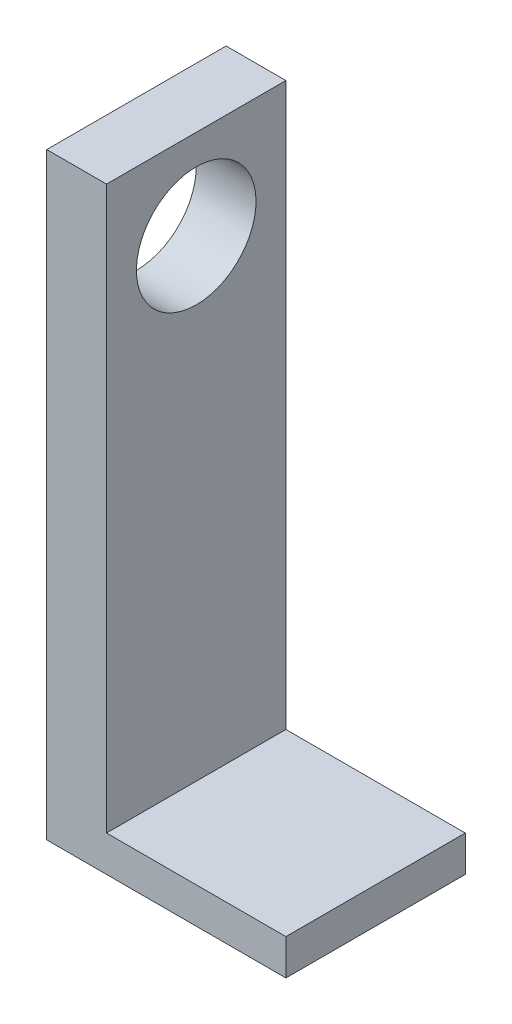
ISO-10303-21;
HEADER;
FILE_DESCRIPTION(('STEP AP214'),'2;1');
FILE_NAME('part.step','',(''),(''),'','','');
FILE_SCHEMA(('AUTOMOTIVE_DESIGN { 1 0 10303 214 1 1 1 1 }'));
ENDSEC;
DATA;
#1=APPLICATION_CONTEXT('core data for automotive mechanical design processes');
#2=APPLICATION_PROTOCOL_DEFINITION('international standard','automotive_design',2000,#1);
#3=PRODUCT_CONTEXT('',#1,'mechanical');
#4=PRODUCT('Part','Part','',(#3));
#5=PRODUCT_RELATED_PRODUCT_CATEGORY('part','',(#4));
#6=PRODUCT_DEFINITION_FORMATION('','',#4);
#7=PRODUCT_DEFINITION_CONTEXT('part definition',#1,'design');
#8=PRODUCT_DEFINITION('design','',#6,#7);
#9=PRODUCT_DEFINITION_SHAPE('','',#8);
#10=(LENGTH_UNIT() NAMED_UNIT(*) SI_UNIT(.MILLI.,.METRE.));
#11=(NAMED_UNIT(*) PLANE_ANGLE_UNIT() SI_UNIT($,.RADIAN.));
#12=(NAMED_UNIT(*) SI_UNIT($,.STERADIAN.) SOLID_ANGLE_UNIT());
#13=UNCERTAINTY_MEASURE_WITH_UNIT(LENGTH_MEASURE(1.E-05),#10,'distance_accuracy_value','');
#14=(GEOMETRIC_REPRESENTATION_CONTEXT(3) GLOBAL_UNCERTAINTY_ASSIGNED_CONTEXT((#13)) GLOBAL_UNIT_ASSIGNED_CONTEXT((#10,
#11,#12)) REPRESENTATION_CONTEXT('',''));
#15=CARTESIAN_POINT('',(0.,0.,0.));
#16=DIRECTION('',(0.,0.,1.));
#17=DIRECTION('',(1.,0.,0.));
#18=AXIS2_PLACEMENT_3D('',#15,#16,#17);
#19=CARTESIAN_POINT('',(0.,50.,15.));
#20=DIRECTION('',(1.,0.,0.));
#21=DIRECTION('',(0.,1.,0.));
#22=AXIS2_PLACEMENT_3D('',#19,#20,#21);
#23=PLANE('',#22);
#24=CARTESIAN_POINT('',(0.,42.5,7.5));
#25=DIRECTION('',(-1.,0.,0.));
#26=DIRECTION('',(0.,-1.,0.));
#27=AXIS2_PLACEMENT_3D('',#24,#25,#26);
#28=CIRCLE('',#27,5.);
#29=CARTESIAN_POINT('',(0.,37.5,7.5));
#30=VERTEX_POINT('',#29);
#31=EDGE_CURVE('E182',#30,#30,#28,.T.);
#32=ORIENTED_EDGE('',*,*,#31,.F.);
#33=EDGE_LOOP('',(#32));
#34=FACE_BOUND('',#33,.T.);
#35=DIRECTION('',(0.,-1.,0.));
#36=VECTOR('',#35,1.);
#37=CARTESIAN_POINT('',(0.,50.,0.));
#38=LINE('',#37,#36);
#39=CARTESIAN_POINT('',(0.,50.,0.));
#40=VERTEX_POINT('',#39);
#41=CARTESIAN_POINT('',(0.,0.,0.));
#42=VERTEX_POINT('',#41);
#43=EDGE_CURVE('E129',#40,#42,#38,.T.);
#44=ORIENTED_EDGE('',*,*,#43,.T.);
#45=DIRECTION('',(0.,0.,-1.));
#46=VECTOR('',#45,1.);
#47=CARTESIAN_POINT('',(0.,0.,15.));
#48=LINE('',#47,#46);
#49=CARTESIAN_POINT('',(0.,0.,15.));
#50=VERTEX_POINT('',#49);
#51=EDGE_CURVE('E11',#50,#42,#48,.T.);
#52=ORIENTED_EDGE('',*,*,#51,.F.);
#53=DIRECTION('',(0.,-1.,0.));
#54=VECTOR('',#53,1.);
#55=CARTESIAN_POINT('',(0.,50.,15.));
#56=LINE('',#55,#54);
#57=CARTESIAN_POINT('',(0.,50.,15.));
#58=VERTEX_POINT('',#57);
#59=EDGE_CURVE('E145',#58,#50,#56,.T.);
#60=ORIENTED_EDGE('',*,*,#59,.F.);
#61=DIRECTION('',(0.,0.,-1.));
#62=VECTOR('',#61,1.);
#63=CARTESIAN_POINT('',(0.,50.,15.));
#64=LINE('',#63,#62);
#65=EDGE_CURVE('E125',#58,#40,#64,.T.);
#66=ORIENTED_EDGE('',*,*,#65,.T.);
#67=EDGE_LOOP('',(#44,#52,#60,#66));
#68=FACE_BOUND('',#67,.T.);
#69=ADVANCED_FACE('F39',(#34,#68),#23,.F.);
#70=CARTESIAN_POINT('',(0.,0.,15.));
#71=DIRECTION('',(0.,1.,0.));
#72=DIRECTION('',(0.,0.,1.));
#73=AXIS2_PLACEMENT_3D('',#70,#71,#72);
#74=PLANE('',#73);
#75=DIRECTION('',(1.,0.,0.));
#76=VECTOR('',#75,1.);
#77=CARTESIAN_POINT('',(0.,0.,0.));
#78=LINE('',#77,#76);
#79=CARTESIAN_POINT('',(20.,0.,0.));
#80=VERTEX_POINT('',#79);
#81=EDGE_CURVE('E133',#42,#80,#78,.T.);
#82=ORIENTED_EDGE('',*,*,#81,.T.);
#83=DIRECTION('',(0.,0.,-1.));
#84=VECTOR('',#83,1.);
#85=CARTESIAN_POINT('',(20.,0.,15.));
#86=LINE('',#85,#84);
#87=CARTESIAN_POINT('',(20.,0.,15.));
#88=VERTEX_POINT('',#87);
#89=EDGE_CURVE('E49',#88,#80,#86,.T.);
#90=ORIENTED_EDGE('',*,*,#89,.F.);
#91=DIRECTION('',(1.,0.,0.));
#92=VECTOR('',#91,1.);
#93=CARTESIAN_POINT('',(0.,0.,15.));
#94=LINE('',#93,#92);
#95=EDGE_CURVE('E94',#50,#88,#94,.T.);
#96=ORIENTED_EDGE('',*,*,#95,.F.);
#97=ORIENTED_EDGE('',*,*,#51,.T.);
#98=EDGE_LOOP('',(#82,#90,#96,#97));
#99=FACE_BOUND('',#98,.T.);
#100=ADVANCED_FACE('F175',(#99),#74,.F.);
#101=CARTESIAN_POINT('',(20.,0.,15.));
#102=DIRECTION('',(-1.,0.,0.));
#103=DIRECTION('',(0.,0.,1.));
#104=AXIS2_PLACEMENT_3D('',#101,#102,#103);
#105=PLANE('',#104);
#106=DIRECTION('',(0.,1.,0.));
#107=VECTOR('',#106,1.);
#108=CARTESIAN_POINT('',(20.,0.,0.));
#109=LINE('',#108,#107);
#110=CARTESIAN_POINT('',(20.,3.,0.));
#111=VERTEX_POINT('',#110);
#112=EDGE_CURVE('E136',#80,#111,#109,.T.);
#113=ORIENTED_EDGE('',*,*,#112,.T.);
#114=DIRECTION('',(0.,0.,-1.));
#115=VECTOR('',#114,1.);
#116=CARTESIAN_POINT('',(20.,3.,15.));
#117=LINE('',#116,#115);
#118=CARTESIAN_POINT('',(20.,3.,15.));
#119=VERTEX_POINT('',#118);
#120=EDGE_CURVE('E118',#119,#111,#117,.T.);
#121=ORIENTED_EDGE('',*,*,#120,.F.);
#122=DIRECTION('',(0.,1.,0.));
#123=VECTOR('',#122,1.);
#124=CARTESIAN_POINT('',(20.,0.,15.));
#125=LINE('',#124,#123);
#126=EDGE_CURVE('E107',#88,#119,#125,.T.);
#127=ORIENTED_EDGE('',*,*,#126,.F.);
#128=ORIENTED_EDGE('',*,*,#89,.T.);
#129=EDGE_LOOP('',(#113,#121,#127,#128));
#130=FACE_BOUND('',#129,.T.);
#131=ADVANCED_FACE('F156',(#130),#105,.F.);
#132=CARTESIAN_POINT('',(20.,3.,15.));
#133=DIRECTION('',(0.,-1.,0.));
#134=DIRECTION('',(1.,0.,0.));
#135=AXIS2_PLACEMENT_3D('',#132,#133,#134);
#136=PLANE('',#135);
#137=DIRECTION('',(-1.,0.,0.));
#138=VECTOR('',#137,1.);
#139=CARTESIAN_POINT('',(20.,3.,0.));
#140=LINE('',#139,#138);
#141=CARTESIAN_POINT('',(5.,3.,0.));
#142=VERTEX_POINT('',#141);
#143=EDGE_CURVE('E116',#111,#142,#140,.T.);
#144=ORIENTED_EDGE('',*,*,#143,.T.);
#145=DIRECTION('',(0.,0.,-1.));
#146=VECTOR('',#145,1.);
#147=CARTESIAN_POINT('',(5.,3.,15.));
#148=LINE('',#147,#146);
#149=CARTESIAN_POINT('',(5.,3.,15.));
#150=VERTEX_POINT('',#149);
#151=EDGE_CURVE('E113',#150,#142,#148,.T.);
#152=ORIENTED_EDGE('',*,*,#151,.F.);
#153=DIRECTION('',(-1.,0.,0.));
#154=VECTOR('',#153,1.);
#155=CARTESIAN_POINT('',(20.,3.,15.));
#156=LINE('',#155,#154);
#157=EDGE_CURVE('E101',#119,#150,#156,.T.);
#158=ORIENTED_EDGE('',*,*,#157,.F.);
#159=ORIENTED_EDGE('',*,*,#120,.T.);
#160=EDGE_LOOP('',(#144,#152,#158,#159));
#161=FACE_BOUND('',#160,.T.);
#162=ADVANCED_FACE('F114',(#161),#136,.F.);
#163=CARTESIAN_POINT('',(5.,3.,15.));
#164=DIRECTION('',(-1.,0.,0.));
#165=DIRECTION('',(0.,-1.,0.));
#166=AXIS2_PLACEMENT_3D('',#163,#164,#165);
#167=PLANE('',#166);
#168=CARTESIAN_POINT('',(5.,42.5,7.5));
#169=DIRECTION('',(-1.,0.,0.));
#170=DIRECTION('',(0.,-1.,0.));
#171=AXIS2_PLACEMENT_3D('',#168,#169,#170);
#172=CIRCLE('',#171,5.);
#173=CARTESIAN_POINT('',(5.,37.5,7.5));
#174=VERTEX_POINT('',#173);
#175=EDGE_CURVE('E42',#174,#174,#172,.T.);
#176=ORIENTED_EDGE('',*,*,#175,.T.);
#177=EDGE_LOOP('',(#176));
#178=FACE_BOUND('',#177,.T.);
#179=DIRECTION('',(0.,1.,0.));
#180=VECTOR('',#179,1.);
#181=CARTESIAN_POINT('',(5.,3.,0.));
#182=LINE('',#181,#180);
#183=CARTESIAN_POINT('',(5.,50.,0.));
#184=VERTEX_POINT('',#183);
#185=EDGE_CURVE('E80',#142,#184,#182,.T.);
#186=ORIENTED_EDGE('',*,*,#185,.T.);
#187=DIRECTION('',(0.,0.,-1.));
#188=VECTOR('',#187,1.);
#189=CARTESIAN_POINT('',(5.,50.,15.));
#190=LINE('',#189,#188);
#191=CARTESIAN_POINT('',(5.,50.,15.));
#192=VERTEX_POINT('',#191);
#193=EDGE_CURVE('E119',#192,#184,#190,.T.);
#194=ORIENTED_EDGE('',*,*,#193,.F.);
#195=DIRECTION('',(0.,1.,0.));
#196=VECTOR('',#195,1.);
#197=CARTESIAN_POINT('',(5.,3.,15.));
#198=LINE('',#197,#196);
#199=EDGE_CURVE('E105',#150,#192,#198,.T.);
#200=ORIENTED_EDGE('',*,*,#199,.F.);
#201=ORIENTED_EDGE('',*,*,#151,.T.);
#202=EDGE_LOOP('',(#186,#194,#200,#201));
#203=FACE_BOUND('',#202,.T.);
#204=ADVANCED_FACE('F121',(#178,#203),#167,.F.);
#205=CARTESIAN_POINT('',(5.,50.,15.));
#206=DIRECTION('',(0.,-1.,0.));
#207=DIRECTION('',(0.,0.,-1.));
#208=AXIS2_PLACEMENT_3D('',#205,#206,#207);
#209=PLANE('',#208);
#210=DIRECTION('',(-1.,0.,0.));
#211=VECTOR('',#210,1.);
#212=CARTESIAN_POINT('',(5.,50.,0.));
#213=LINE('',#212,#211);
#214=EDGE_CURVE('E86',#184,#40,#213,.T.);
#215=ORIENTED_EDGE('',*,*,#214,.T.);
#216=ORIENTED_EDGE('',*,*,#65,.F.);
#217=DIRECTION('',(-1.,0.,0.));
#218=VECTOR('',#217,1.);
#219=CARTESIAN_POINT('',(5.,50.,15.));
#220=LINE('',#219,#218);
#221=EDGE_CURVE('E57',#192,#58,#220,.T.);
#222=ORIENTED_EDGE('',*,*,#221,.F.);
#223=ORIENTED_EDGE('',*,*,#193,.T.);
#224=EDGE_LOOP('',(#215,#216,#222,#223));
#225=FACE_BOUND('',#224,.T.);
#226=ADVANCED_FACE('F163',(#225),#209,.F.);
#227=CARTESIAN_POINT('',(0.,0.,15.));
#228=DIRECTION('',(0.,0.,1.));
#229=DIRECTION('',(1.,0.,0.));
#230=AXIS2_PLACEMENT_3D('',#227,#228,#229);
#231=PLANE('',#230);
#232=ORIENTED_EDGE('',*,*,#59,.T.);
#233=ORIENTED_EDGE('',*,*,#95,.T.);
#234=ORIENTED_EDGE('',*,*,#126,.T.);
#235=ORIENTED_EDGE('',*,*,#157,.T.);
#236=ORIENTED_EDGE('',*,*,#199,.T.);
#237=ORIENTED_EDGE('',*,*,#221,.T.);
#238=EDGE_LOOP('',(#232,#233,#234,#235,#236,#237));
#239=FACE_BOUND('',#238,.T.);
#240=ADVANCED_FACE('F103',(#239),#231,.T.);
#241=CARTESIAN_POINT('',(0.,0.,0.));
#242=DIRECTION('',(0.,0.,1.));
#243=DIRECTION('',(1.,0.,0.));
#244=AXIS2_PLACEMENT_3D('',#241,#242,#243);
#245=PLANE('',#244);
#246=ORIENTED_EDGE('',*,*,#43,.F.);
#247=ORIENTED_EDGE('',*,*,#214,.F.);
#248=ORIENTED_EDGE('',*,*,#185,.F.);
#249=ORIENTED_EDGE('',*,*,#143,.F.);
#250=ORIENTED_EDGE('',*,*,#112,.F.);
#251=ORIENTED_EDGE('',*,*,#81,.F.);
#252=EDGE_LOOP('',(#246,#247,#248,#249,#250,#251));
#253=FACE_BOUND('',#252,.T.);
#254=ADVANCED_FACE('F159',(#253),#245,.F.);
#255=CARTESIAN_POINT('',(20.,42.5,7.5));
#256=DIRECTION('',(-1.,0.,0.));
#257=DIRECTION('',(0.,-1.,0.));
#258=AXIS2_PLACEMENT_3D('',#255,#256,#257);
#259=CYLINDRICAL_SURFACE('',#258,5.);
#260=ORIENTED_EDGE('',*,*,#31,.T.);
#261=EDGE_LOOP('',(#260));
#262=FACE_BOUND('',#261,.T.);
#263=ORIENTED_EDGE('',*,*,#175,.F.);
#264=EDGE_LOOP('',(#263));
#265=FACE_BOUND('',#264,.T.);
#266=ADVANCED_FACE('F195',(#262,#265),#259,.F.);
#267=CLOSED_SHELL('',(#69,#100,#131,#162,#204,#226,#240,#254,#266));
#268=MANIFOLD_SOLID_BREP('B2',#267);
#269=ADVANCED_BREP_SHAPE_REPRESENTATION('',(#18,#268),#14);
#270=SHAPE_DEFINITION_REPRESENTATION(#9,#269);
ENDSEC;
END-ISO-10303-21;
